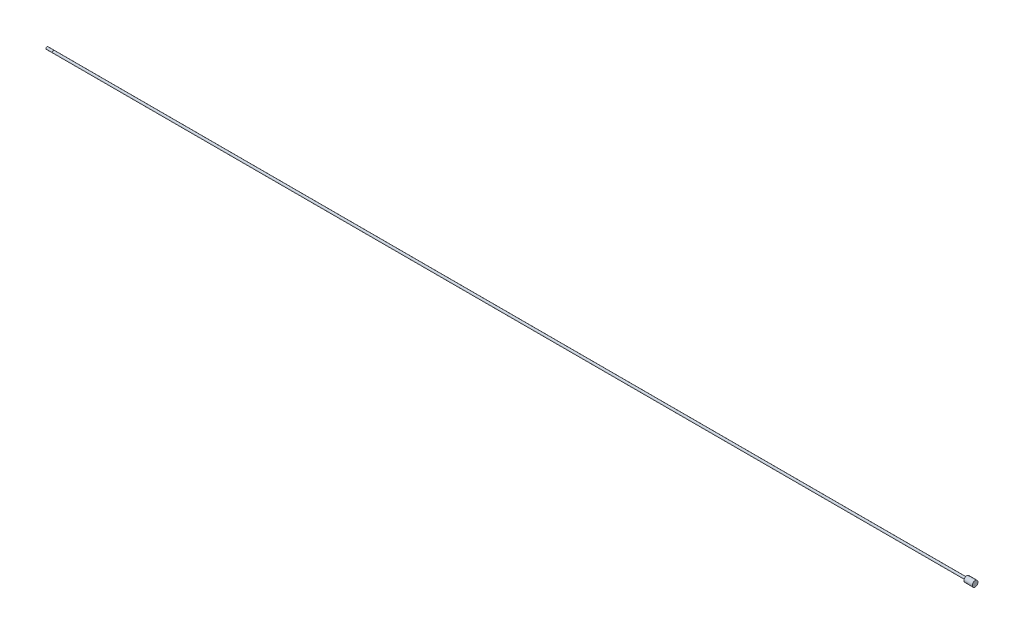
ISO-10303-21;
HEADER;
FILE_DESCRIPTION(('STEP AP214'),'2;1');
FILE_NAME('part.step','',(''),(''),'','','');
FILE_SCHEMA(('AUTOMOTIVE_DESIGN { 1 0 10303 214 1 1 1 1 }'));
ENDSEC;
DATA;
#1=APPLICATION_CONTEXT('core data for automotive mechanical design processes');
#2=APPLICATION_PROTOCOL_DEFINITION('international standard','automotive_design',2000,#1);
#3=PRODUCT_CONTEXT('',#1,'mechanical');
#4=PRODUCT('Part','Part','',(#3));
#5=PRODUCT_RELATED_PRODUCT_CATEGORY('part','',(#4));
#6=PRODUCT_DEFINITION_FORMATION('','',#4);
#7=PRODUCT_DEFINITION_CONTEXT('part definition',#1,'design');
#8=PRODUCT_DEFINITION('design','',#6,#7);
#9=PRODUCT_DEFINITION_SHAPE('','',#8);
#10=(LENGTH_UNIT() NAMED_UNIT(*) SI_UNIT(.MILLI.,.METRE.));
#11=(NAMED_UNIT(*) PLANE_ANGLE_UNIT() SI_UNIT($,.RADIAN.));
#12=(NAMED_UNIT(*) SI_UNIT($,.STERADIAN.) SOLID_ANGLE_UNIT());
#13=UNCERTAINTY_MEASURE_WITH_UNIT(LENGTH_MEASURE(1.E-05),#10,'distance_accuracy_value','');
#14=(GEOMETRIC_REPRESENTATION_CONTEXT(3) GLOBAL_UNCERTAINTY_ASSIGNED_CONTEXT((#13)) GLOBAL_UNIT_ASSIGNED_CONTEXT((#10,
#11,#12)) REPRESENTATION_CONTEXT('',''));
#15=CARTESIAN_POINT('',(0.,0.,0.));
#16=DIRECTION('',(0.,0.,1.));
#17=DIRECTION('',(1.,0.,0.));
#18=AXIS2_PLACEMENT_3D('',#15,#16,#17);
#19=CARTESIAN_POINT('',(1303.2994,0.,0.));
#20=DIRECTION('',(-1.,0.,0.));
#21=DIRECTION('',(0.,0.,1.));
#22=AXIS2_PLACEMENT_3D('',#19,#20,#21);
#23=CYLINDRICAL_SURFACE('',#22,1.5875);
#24=CARTESIAN_POINT('',(1291.463,0.,0.));
#25=DIRECTION('',(-1.,0.,0.));
#26=DIRECTION('',(0.,0.,1.));
#27=AXIS2_PLACEMENT_3D('',#24,#25,#26);
#28=CIRCLE('',#27,1.5875);
#29=CARTESIAN_POINT('',(1291.463,0.,1.5875));
#30=VERTEX_POINT('',#29);
#31=EDGE_CURVE('E10',#30,#30,#28,.T.);
#32=ORIENTED_EDGE('',*,*,#31,.T.);
#33=EDGE_LOOP('',(#32));
#34=FACE_BOUND('',#33,.T.);
#35=CARTESIAN_POINT('',(0.,0.,0.));
#36=DIRECTION('',(-1.,0.,0.));
#37=DIRECTION('',(0.,0.,1.));
#38=AXIS2_PLACEMENT_3D('',#35,#36,#37);
#39=CIRCLE('',#38,1.5875);
#40=CARTESIAN_POINT('',(0.,0.,1.5875));
#41=VERTEX_POINT('',#40);
#42=EDGE_CURVE('E50',#41,#41,#39,.T.);
#43=ORIENTED_EDGE('',*,*,#42,.F.);
#44=EDGE_LOOP('',(#43));
#45=FACE_BOUND('',#44,.T.);
#46=ADVANCED_FACE('F34',(#34,#45),#23,.T.);
#47=CARTESIAN_POINT('',(1291.463,1.5875,0.));
#48=DIRECTION('',(1.,0.,0.));
#49=DIRECTION('',(0.,0.,-1.));
#50=AXIS2_PLACEMENT_3D('',#47,#48,#49);
#51=PLANE('',#50);
#52=ORIENTED_EDGE('',*,*,#31,.F.);
#53=EDGE_LOOP('',(#52));
#54=FACE_BOUND('',#53,.T.);
#55=CARTESIAN_POINT('',(1291.463,0.,0.));
#56=DIRECTION('',(-1.,0.,0.));
#57=DIRECTION('',(0.,0.,1.));
#58=AXIS2_PLACEMENT_3D('',#55,#56,#57);
#59=CIRCLE('',#58,4.03225);
#60=CARTESIAN_POINT('',(1291.463,0.,4.03225));
#61=VERTEX_POINT('',#60);
#62=EDGE_CURVE('E42',#61,#61,#59,.T.);
#63=ORIENTED_EDGE('',*,*,#62,.T.);
#64=EDGE_LOOP('',(#63));
#65=FACE_BOUND('',#64,.T.);
#66=ADVANCED_FACE('F84',(#54,#65),#51,.F.);
#67=CARTESIAN_POINT('',(1303.2994,0.,0.));
#68=DIRECTION('',(-1.,0.,0.));
#69=DIRECTION('',(0.,0.,1.));
#70=AXIS2_PLACEMENT_3D('',#67,#68,#69);
#71=CYLINDRICAL_SURFACE('',#70,4.03225);
#72=ORIENTED_EDGE('',*,*,#62,.F.);
#73=EDGE_LOOP('',(#72));
#74=FACE_BOUND('',#73,.T.);
#75=CARTESIAN_POINT('',(1303.2994,0.,0.));
#76=DIRECTION('',(-1.,0.,0.));
#77=DIRECTION('',(0.,0.,1.));
#78=AXIS2_PLACEMENT_3D('',#75,#76,#77);
#79=CIRCLE('',#78,4.03225);
#80=CARTESIAN_POINT('',(1303.2994,0.,4.03225));
#81=VERTEX_POINT('',#80);
#82=EDGE_CURVE('E47',#81,#81,#79,.T.);
#83=ORIENTED_EDGE('',*,*,#82,.T.);
#84=EDGE_LOOP('',(#83));
#85=FACE_BOUND('',#84,.T.);
#86=ADVANCED_FACE('F72',(#74,#85),#71,.T.);
#87=CARTESIAN_POINT('',(1303.2994,4.03225,0.));
#88=DIRECTION('',(-1.,0.,0.));
#89=DIRECTION('',(0.,0.,1.));
#90=AXIS2_PLACEMENT_3D('',#87,#88,#89);
#91=PLANE('',#90);
#92=ORIENTED_EDGE('',*,*,#82,.F.);
#93=EDGE_LOOP('',(#92));
#94=FACE_BOUND('',#93,.T.);
#95=ADVANCED_FACE('F74',(#94),#91,.F.);
#96=CARTESIAN_POINT('',(-0.254,1.8415,0.));
#97=DIRECTION('',(1.,0.,0.));
#98=DIRECTION('',(0.,0.,-1.));
#99=AXIS2_PLACEMENT_3D('',#96,#97,#98);
#100=PLANE('',#99);
#101=CARTESIAN_POINT('',(-0.254,0.,0.));
#102=DIRECTION('',(-1.,0.,0.));
#103=DIRECTION('',(0.,0.,1.));
#104=AXIS2_PLACEMENT_3D('',#101,#102,#103);
#105=CIRCLE('',#104,1.3335);
#106=CARTESIAN_POINT('',(-0.254,0.,1.3335));
#107=VERTEX_POINT('',#106);
#108=EDGE_CURVE('E52',#107,#107,#105,.T.);
#109=ORIENTED_EDGE('',*,*,#108,.T.);
#110=EDGE_LOOP('',(#109));
#111=FACE_BOUND('',#110,.T.);
#112=CARTESIAN_POINT('',(-0.253999999999976,0.,0.));
#113=DIRECTION('',(1.,0.,0.));
#114=DIRECTION('',(0.,0.,-1.));
#115=AXIS2_PLACEMENT_3D('',#112,#113,#114);
#116=CIRCLE('',#115,1.5875);
#117=CARTESIAN_POINT('',(-0.253999999999976,0.,-1.5875));
#118=VERTEX_POINT('',#117);
#119=EDGE_CURVE('E38',#118,#118,#116,.T.);
#120=ORIENTED_EDGE('',*,*,#119,.T.);
#121=EDGE_LOOP('',(#120));
#122=FACE_BOUND('',#121,.T.);
#123=ADVANCED_FACE('F76',(#111,#122),#100,.T.);
#124=CARTESIAN_POINT('',(0.,1.3335,0.));
#125=DIRECTION('',(-1.,0.,0.));
#126=DIRECTION('',(0.,0.,1.));
#127=AXIS2_PLACEMENT_3D('',#124,#125,#126);
#128=PLANE('',#127);
#129=CARTESIAN_POINT('',(0.,0.,0.));
#130=DIRECTION('',(-1.,0.,0.));
#131=DIRECTION('',(0.,0.,1.));
#132=AXIS2_PLACEMENT_3D('',#129,#130,#131);
#133=CIRCLE('',#132,1.3335);
#134=CARTESIAN_POINT('',(0.,0.,1.3335));
#135=VERTEX_POINT('',#134);
#136=EDGE_CURVE('E58',#135,#135,#133,.T.);
#137=ORIENTED_EDGE('',*,*,#136,.F.);
#138=EDGE_LOOP('',(#137));
#139=FACE_BOUND('',#138,.T.);
#140=ORIENTED_EDGE('',*,*,#42,.T.);
#141=EDGE_LOOP('',(#140));
#142=FACE_BOUND('',#141,.T.);
#143=ADVANCED_FACE('F82',(#139,#142),#128,.T.);
#144=CARTESIAN_POINT('',(0.,0.,0.));
#145=DIRECTION('',(-1.,0.,0.));
#146=DIRECTION('',(0.,0.,1.));
#147=AXIS2_PLACEMENT_3D('',#144,#145,#146);
#148=CYLINDRICAL_SURFACE('',#147,1.3335);
#149=ORIENTED_EDGE('',*,*,#136,.T.);
#150=EDGE_LOOP('',(#149));
#151=FACE_BOUND('',#150,.T.);
#152=ORIENTED_EDGE('',*,*,#108,.F.);
#153=EDGE_LOOP('',(#152));
#154=FACE_BOUND('',#153,.T.);
#155=ADVANCED_FACE('F111',(#151,#154),#148,.T.);
#156=CARTESIAN_POINT('',(-9.652,0.,0.));
#157=DIRECTION('',(1.,0.,0.));
#158=DIRECTION('',(0.,0.,-1.));
#159=AXIS2_PLACEMENT_3D('',#156,#157,#158);
#160=PLANE('',#159);
#161=CARTESIAN_POINT('',(-9.652,0.,0.));
#162=DIRECTION('',(-1.,0.,0.));
#163=DIRECTION('',(0.,0.,1.));
#164=AXIS2_PLACEMENT_3D('',#161,#162,#163);
#165=CIRCLE('',#164,1.20904);
#166=CARTESIAN_POINT('',(-9.652,0.,1.20904));
#167=VERTEX_POINT('',#166);
#168=EDGE_CURVE('E67',#167,#167,#165,.T.);
#169=ORIENTED_EDGE('',*,*,#168,.T.);
#170=EDGE_LOOP('',(#169));
#171=FACE_BOUND('',#170,.T.);
#172=ADVANCED_FACE('F100',(#171),#160,.F.);
#173=CARTESIAN_POINT('',(-9.27354,0.,0.));
#174=DIRECTION('',(1.,0.,0.));
#175=DIRECTION('',(0.,0.,-1.));
#176=AXIS2_PLACEMENT_3D('',#173,#174,#175);
#177=CONICAL_SURFACE('',#176,1.5875,0.78539816339745);
#178=ORIENTED_EDGE('',*,*,#168,.F.);
#179=EDGE_LOOP('',(#178));
#180=FACE_BOUND('',#179,.T.);
#181=CARTESIAN_POINT('',(-9.27354,0.,0.));
#182=DIRECTION('',(-1.,0.,0.));
#183=DIRECTION('',(0.,0.,1.));
#184=AXIS2_PLACEMENT_3D('',#181,#182,#183);
#185=CIRCLE('',#184,1.5875);
#186=CARTESIAN_POINT('',(-9.27354,0.,1.5875));
#187=VERTEX_POINT('',#186);
#188=EDGE_CURVE('E56',#187,#187,#185,.T.);
#189=ORIENTED_EDGE('',*,*,#188,.T.);
#190=EDGE_LOOP('',(#189));
#191=FACE_BOUND('',#190,.T.);
#192=ADVANCED_FACE('F95',(#180,#191),#177,.T.);
#193=ORIENTED_EDGE('',*,*,#188,.F.);
#194=EDGE_LOOP('',(#193));
#195=FACE_BOUND('',#194,.T.);
#196=ORIENTED_EDGE('',*,*,#119,.F.);
#197=EDGE_LOOP('',(#196));
#198=FACE_BOUND('',#197,.T.);
#199=ADVANCED_FACE('F36',(#195,#198),#23,.T.);
#200=CLOSED_SHELL('',(#46,#66,#86,#95,#123,#143,#155,#172,#192,#199));
#201=MANIFOLD_SOLID_BREP('B2',#200);
#202=ADVANCED_BREP_SHAPE_REPRESENTATION('',(#18,#201),#14);
#203=SHAPE_DEFINITION_REPRESENTATION(#9,#202);
ENDSEC;
END-ISO-10303-21;
